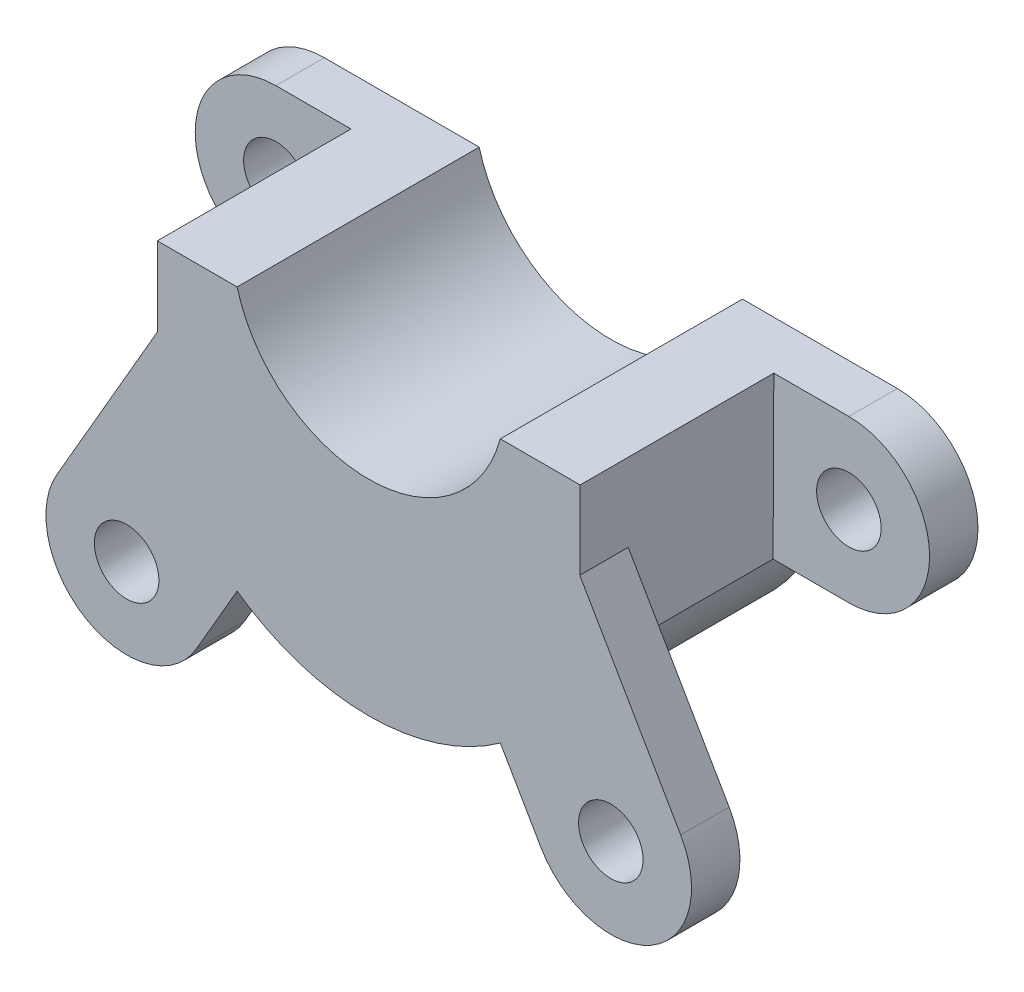
ISO-10303-21;
HEADER;
FILE_DESCRIPTION(('STEP AP214'),'2;1');
FILE_NAME('part.step','',(''),(''),'','','');
FILE_SCHEMA(('AUTOMOTIVE_DESIGN { 1 0 10303 214 1 1 1 1 }'));
ENDSEC;
DATA;
#1=APPLICATION_CONTEXT('core data for automotive mechanical design processes');
#2=APPLICATION_PROTOCOL_DEFINITION('international standard','automotive_design',2000,#1);
#3=PRODUCT_CONTEXT('',#1,'mechanical');
#4=PRODUCT('Part','Part','',(#3));
#5=PRODUCT_RELATED_PRODUCT_CATEGORY('part','',(#4));
#6=PRODUCT_DEFINITION_FORMATION('','',#4);
#7=PRODUCT_DEFINITION_CONTEXT('part definition',#1,'design');
#8=PRODUCT_DEFINITION('design','',#6,#7);
#9=PRODUCT_DEFINITION_SHAPE('','',#8);
#10=(LENGTH_UNIT() NAMED_UNIT(*) SI_UNIT(.MILLI.,.METRE.));
#11=(NAMED_UNIT(*) PLANE_ANGLE_UNIT() SI_UNIT($,.RADIAN.));
#12=(NAMED_UNIT(*) SI_UNIT($,.STERADIAN.) SOLID_ANGLE_UNIT());
#13=UNCERTAINTY_MEASURE_WITH_UNIT(LENGTH_MEASURE(1.E-05),#10,'distance_accuracy_value','');
#14=(GEOMETRIC_REPRESENTATION_CONTEXT(3) GLOBAL_UNCERTAINTY_ASSIGNED_CONTEXT((#13)) GLOBAL_UNIT_ASSIGNED_CONTEXT((#10,
#11,#12)) REPRESENTATION_CONTEXT('',''));
#15=CARTESIAN_POINT('',(0.,0.,0.));
#16=DIRECTION('',(0.,0.,1.));
#17=DIRECTION('',(1.,0.,0.));
#18=AXIS2_PLACEMENT_3D('',#15,#16,#17);
#19=CARTESIAN_POINT('',(0.,0.,3.));
#20=DIRECTION('',(0.,0.,1.));
#21=DIRECTION('',(1.,0.,0.));
#22=AXIS2_PLACEMENT_3D('',#19,#20,#21);
#23=PLANE('',#22);
#24=DIRECTION('',(0.00451459916216712,-0.999989809145276,0.));
#25=VECTOR('',#24,1.);
#26=CARTESIAN_POINT('',(-13.0539708590858,-5.05903595659676,3.));
#27=LINE('',#26,#25);
#28=CARTESIAN_POINT('',(-13.0991173107884,4.94096404340324,3.));
#29=VERTEX_POINT('',#28);
#30=CARTESIAN_POINT('',(-13.0539708590858,-5.05903595659676,3.));
#31=VERTEX_POINT('',#30);
#32=EDGE_CURVE('E56',#29,#31,#27,.T.);
#33=ORIENTED_EDGE('',*,*,#32,.F.);
#34=DIRECTION('',(-1.,0.,0.));
#35=VECTOR('',#34,1.);
#36=CARTESIAN_POINT('',(-13.0991173107884,4.94096404340325,3.));
#37=LINE('',#36,#35);
#38=CARTESIAN_POINT('',(-17.75,4.94096404340325,3.));
#39=VERTEX_POINT('',#38);
#40=EDGE_CURVE('E291',#29,#39,#37,.T.);
#41=ORIENTED_EDGE('',*,*,#40,.T.);
#42=CARTESIAN_POINT('',(-17.75,-0.0590359565967556,3.));
#43=DIRECTION('',(0.,0.,1.));
#44=DIRECTION('',(1.,0.,0.));
#45=AXIS2_PLACEMENT_3D('',#42,#43,#44);
#46=CIRCLE('',#45,5.);
#47=CARTESIAN_POINT('',(-17.75,-5.05903595659675,3.));
#48=VERTEX_POINT('',#47);
#49=EDGE_CURVE('E293',#39,#48,#46,.T.);
#50=ORIENTED_EDGE('',*,*,#49,.T.);
#51=DIRECTION('',(1.,0.,0.));
#52=VECTOR('',#51,1.);
#53=CARTESIAN_POINT('',(-17.75,-5.05903595659675,3.));
#54=LINE('',#53,#52);
#55=EDGE_CURVE('E295',#48,#31,#54,.T.);
#56=ORIENTED_EDGE('',*,*,#55,.T.);
#57=EDGE_LOOP('',(#33,#41,#50,#56));
#58=FACE_BOUND('',#57,.T.);
#59=CARTESIAN_POINT('',(-17.75,-0.0590359565967556,3.));
#60=DIRECTION('',(0.,0.,1.));
#61=DIRECTION('',(1.,0.,0.));
#62=AXIS2_PLACEMENT_3D('',#59,#60,#61);
#63=CIRCLE('',#62,2.);
#64=CARTESIAN_POINT('',(-15.75,-0.0590359565967556,3.));
#65=VERTEX_POINT('',#64);
#66=EDGE_CURVE('E278',#65,#65,#63,.T.);
#67=ORIENTED_EDGE('',*,*,#66,.F.);
#68=EDGE_LOOP('',(#67));
#69=FACE_BOUND('',#68,.T.);
#70=ADVANCED_FACE('F33',(#58,#69),#23,.T.);
#71=DIRECTION('',(0.00451459916216712,0.999989809145276,0.));
#72=VECTOR('',#71,1.);
#73=CARTESIAN_POINT('',(13.0991173107884,4.94096404340325,3.));
#74=LINE('',#73,#72);
#75=CARTESIAN_POINT('',(13.0539708590858,-5.05903595659676,3.));
#76=VERTEX_POINT('',#75);
#77=CARTESIAN_POINT('',(13.0991173107884,4.94096404340325,3.));
#78=VERTEX_POINT('',#77);
#79=EDGE_CURVE('E242',#76,#78,#74,.T.);
#80=ORIENTED_EDGE('',*,*,#79,.F.);
#81=DIRECTION('',(1.,0.,0.));
#82=VECTOR('',#81,1.);
#83=CARTESIAN_POINT('',(13.0539708590858,-5.05903595659676,3.));
#84=LINE('',#83,#82);
#85=CARTESIAN_POINT('',(17.75,-5.05903595659676,3.));
#86=VERTEX_POINT('',#85);
#87=EDGE_CURVE('E284',#76,#86,#84,.T.);
#88=ORIENTED_EDGE('',*,*,#87,.T.);
#89=CARTESIAN_POINT('',(17.75,-0.0590359565967548,3.));
#90=DIRECTION('',(0.,0.,1.));
#91=DIRECTION('',(1.,0.,0.));
#92=AXIS2_PLACEMENT_3D('',#89,#90,#91);
#93=CIRCLE('',#92,5.);
#94=CARTESIAN_POINT('',(17.75,4.94096404340325,3.));
#95=VERTEX_POINT('',#94);
#96=EDGE_CURVE('E286',#86,#95,#93,.T.);
#97=ORIENTED_EDGE('',*,*,#96,.T.);
#98=DIRECTION('',(-1.,0.,0.));
#99=VECTOR('',#98,1.);
#100=CARTESIAN_POINT('',(17.75,4.94096404340325,3.));
#101=LINE('',#100,#99);
#102=EDGE_CURVE('E289',#95,#78,#101,.T.);
#103=ORIENTED_EDGE('',*,*,#102,.T.);
#104=EDGE_LOOP('',(#80,#88,#97,#103));
#105=FACE_BOUND('',#104,.T.);
#106=CARTESIAN_POINT('',(17.75,-0.0590359565967548,3.));
#107=DIRECTION('',(0.,0.,1.));
#108=DIRECTION('',(1.,0.,0.));
#109=AXIS2_PLACEMENT_3D('',#106,#107,#108);
#110=CIRCLE('',#109,2.);
#111=CARTESIAN_POINT('',(19.75,-0.0590359565967548,3.));
#112=VERTEX_POINT('',#111);
#113=EDGE_CURVE('E272',#112,#112,#110,.T.);
#114=ORIENTED_EDGE('',*,*,#113,.F.);
#115=EDGE_LOOP('',(#114));
#116=FACE_BOUND('',#115,.T.);
#117=ADVANCED_FACE('F381',(#105,#116),#23,.T.);
#118=CARTESIAN_POINT('',(0.,0.,0.));
#119=DIRECTION('',(0.,0.,1.));
#120=DIRECTION('',(1.,0.,0.));
#121=AXIS2_PLACEMENT_3D('',#118,#119,#120);
#122=PLANE('',#121);
#123=CARTESIAN_POINT('',(0.,0.,0.));
#124=DIRECTION('',(0.,0.,1.));
#125=DIRECTION('',(1.,0.,0.));
#126=AXIS2_PLACEMENT_3D('',#123,#124,#125);
#127=CIRCLE('',#126,14.);
#128=CARTESIAN_POINT('',(-13.0539708590858,-5.05903595659676,0.));
#129=VERTEX_POINT('',#128);
#130=CARTESIAN_POINT('',(13.0539708590858,-5.05903595659676,0.));
#131=VERTEX_POINT('',#130);
#132=EDGE_CURVE('E281',#129,#131,#127,.T.);
#133=ORIENTED_EDGE('',*,*,#132,.F.);
#134=DIRECTION('',(1.,0.,0.));
#135=VECTOR('',#134,1.);
#136=CARTESIAN_POINT('',(-17.75,-5.05903595659675,0.));
#137=LINE('',#136,#135);
#138=CARTESIAN_POINT('',(-17.75,-5.05903595659675,0.));
#139=VERTEX_POINT('',#138);
#140=EDGE_CURVE('E287',#139,#129,#137,.T.);
#141=ORIENTED_EDGE('',*,*,#140,.F.);
#142=CARTESIAN_POINT('',(-17.75,-0.0590359565967556,0.));
#143=DIRECTION('',(0.,0.,1.));
#144=DIRECTION('',(1.,0.,0.));
#145=AXIS2_PLACEMENT_3D('',#142,#143,#144);
#146=CIRCLE('',#145,5.);
#147=CARTESIAN_POINT('',(-17.75,4.94096404340325,0.));
#148=VERTEX_POINT('',#147);
#149=EDGE_CURVE('E312',#148,#139,#146,.T.);
#150=ORIENTED_EDGE('',*,*,#149,.F.);
#151=DIRECTION('',(-1.,0.,0.));
#152=VECTOR('',#151,1.);
#153=CARTESIAN_POINT('',(-17.75,4.94096404340325,0.));
#154=LINE('',#153,#152);
#155=CARTESIAN_POINT('',(-8.15478239736566,4.94096404340325,0.));
#156=VERTEX_POINT('',#155);
#157=EDGE_CURVE('E310',#156,#148,#154,.T.);
#158=ORIENTED_EDGE('',*,*,#157,.F.);
#159=CARTESIAN_POINT('',(0.,7.14498862529922,0.));
#160=DIRECTION('',(0.,0.,-1.));
#161=DIRECTION('',(1.,0.,0.));
#162=AXIS2_PLACEMENT_3D('',#159,#160,#161);
#163=CIRCLE('',#162,8.44737830962876);
#164=CARTESIAN_POINT('',(8.15478239736565,4.94096404340324,0.));
#165=VERTEX_POINT('',#164);
#166=EDGE_CURVE('E307',#165,#156,#163,.T.);
#167=ORIENTED_EDGE('',*,*,#166,.F.);
#168=DIRECTION('',(-1.,0.,0.));
#169=VECTOR('',#168,1.);
#170=CARTESIAN_POINT('',(8.15478239736566,4.94096404340325,0.));
#171=LINE('',#170,#169);
#172=CARTESIAN_POINT('',(17.75,4.94096404340325,0.));
#173=VERTEX_POINT('',#172);
#174=EDGE_CURVE('E305',#173,#165,#171,.T.);
#175=ORIENTED_EDGE('',*,*,#174,.F.);
#176=CARTESIAN_POINT('',(17.75,-0.0590359565967548,0.));
#177=DIRECTION('',(0.,0.,1.));
#178=DIRECTION('',(1.,0.,0.));
#179=AXIS2_PLACEMENT_3D('',#176,#177,#178);
#180=CIRCLE('',#179,5.);
#181=CARTESIAN_POINT('',(17.75,-5.05903595659676,0.));
#182=VERTEX_POINT('',#181);
#183=EDGE_CURVE('E302',#182,#173,#180,.T.);
#184=ORIENTED_EDGE('',*,*,#183,.F.);
#185=DIRECTION('',(1.,0.,0.));
#186=VECTOR('',#185,1.);
#187=CARTESIAN_POINT('',(13.0539708590858,-5.05903595659676,0.));
#188=LINE('',#187,#186);
#189=EDGE_CURVE('E300',#131,#182,#188,.T.);
#190=ORIENTED_EDGE('',*,*,#189,.F.);
#191=EDGE_LOOP('',(#133,#141,#150,#158,#167,#175,#184,#190));
#192=FACE_BOUND('',#191,.T.);
#193=CARTESIAN_POINT('',(-17.75,-0.0590359565967556,0.));
#194=DIRECTION('',(0.,0.,1.));
#195=DIRECTION('',(1.,0.,0.));
#196=AXIS2_PLACEMENT_3D('',#193,#194,#195);
#197=CIRCLE('',#196,2.);
#198=CARTESIAN_POINT('',(-15.75,-0.0590359565967556,0.));
#199=VERTEX_POINT('',#198);
#200=EDGE_CURVE('E275',#199,#199,#197,.T.);
#201=ORIENTED_EDGE('',*,*,#200,.T.);
#202=EDGE_LOOP('',(#201));
#203=FACE_BOUND('',#202,.T.);
#204=CARTESIAN_POINT('',(17.75,-0.0590359565967548,0.));
#205=DIRECTION('',(0.,0.,1.));
#206=DIRECTION('',(1.,0.,0.));
#207=AXIS2_PLACEMENT_3D('',#204,#205,#206);
#208=CIRCLE('',#207,2.);
#209=CARTESIAN_POINT('',(19.75,-0.0590359565967548,0.));
#210=VERTEX_POINT('',#209);
#211=EDGE_CURVE('E271',#210,#210,#208,.T.);
#212=ORIENTED_EDGE('',*,*,#211,.T.);
#213=EDGE_LOOP('',(#212));
#214=FACE_BOUND('',#213,.T.);
#215=ADVANCED_FACE('F406',(#192,#203,#214),#122,.F.);
#216=CARTESIAN_POINT('',(0.,0.,3.));
#217=DIRECTION('',(0.,0.,-1.));
#218=DIRECTION('',(-1.,0.,0.));
#219=AXIS2_PLACEMENT_3D('',#216,#217,#218);
#220=CYLINDRICAL_SURFACE('',#219,14.);
#221=CARTESIAN_POINT('',(0.,0.,15.));
#222=DIRECTION('',(0.,0.,1.));
#223=DIRECTION('',(1.,0.,0.));
#224=AXIS2_PLACEMENT_3D('',#221,#222,#223);
#225=CIRCLE('',#224,14.);
#226=CARTESIAN_POINT('',(-8.15478239736565,-11.3797857647504,15.));
#227=VERTEX_POINT('',#226);
#228=CARTESIAN_POINT('',(8.15478239736565,-11.3797857647504,15.));
#229=VERTEX_POINT('',#228);
#230=EDGE_CURVE('E243',#227,#229,#225,.T.);
#231=ORIENTED_EDGE('',*,*,#230,.F.);
#232=DIRECTION('',(0.,0.,1.));
#233=VECTOR('',#232,1.);
#234=CARTESIAN_POINT('',(-8.15478239736565,-11.3797857647504,12.));
#235=LINE('',#234,#233);
#236=CARTESIAN_POINT('',(-8.15478239736565,-11.3797857647504,12.));
#237=VERTEX_POINT('',#236);
#238=EDGE_CURVE('E177',#237,#227,#235,.T.);
#239=ORIENTED_EDGE('',*,*,#238,.F.);
#240=CARTESIAN_POINT('',(0.,0.,12.));
#241=DIRECTION('',(0.,0.,-1.));
#242=DIRECTION('',(-1.,0.,0.));
#243=AXIS2_PLACEMENT_3D('',#240,#241,#242);
#244=CIRCLE('',#243,14.);
#245=CARTESIAN_POINT('',(-13.0539708590858,-5.05903595659676,12.));
#246=VERTEX_POINT('',#245);
#247=EDGE_CURVE('E187',#237,#246,#244,.T.);
#248=ORIENTED_EDGE('',*,*,#247,.T.);
#249=DIRECTION('',(0.,0.,-1.));
#250=VECTOR('',#249,1.);
#251=CARTESIAN_POINT('',(-13.0539708590858,-5.05903595659676,15.));
#252=LINE('',#251,#250);
#253=EDGE_CURVE('E258',#246,#31,#252,.T.);
#254=ORIENTED_EDGE('',*,*,#253,.T.);
#255=DIRECTION('',(0.,0.,-1.));
#256=VECTOR('',#255,1.);
#257=CARTESIAN_POINT('',(-13.0539708590858,-5.05903595659676,3.));
#258=LINE('',#257,#256);
#259=EDGE_CURVE('E297',#31,#129,#258,.T.);
#260=ORIENTED_EDGE('',*,*,#259,.T.);
#261=ORIENTED_EDGE('',*,*,#132,.T.);
#262=DIRECTION('',(0.,0.,-1.));
#263=VECTOR('',#262,1.);
#264=CARTESIAN_POINT('',(13.0539708590858,-5.05903595659676,3.));
#265=LINE('',#264,#263);
#266=EDGE_CURVE('E335',#76,#131,#265,.T.);
#267=ORIENTED_EDGE('',*,*,#266,.F.);
#268=DIRECTION('',(0.,0.,-1.));
#269=VECTOR('',#268,1.);
#270=CARTESIAN_POINT('',(13.0539708590858,-5.05903595659676,15.));
#271=LINE('',#270,#269);
#272=CARTESIAN_POINT('',(13.0539708590858,-5.05903595659676,12.));
#273=VERTEX_POINT('',#272);
#274=EDGE_CURVE('E269',#273,#76,#271,.T.);
#275=ORIENTED_EDGE('',*,*,#274,.F.);
#276=CARTESIAN_POINT('',(0.,0.,12.));
#277=DIRECTION('',(0.,0.,1.));
#278=DIRECTION('',(1.,0.,0.));
#279=AXIS2_PLACEMENT_3D('',#276,#277,#278);
#280=CIRCLE('',#279,14.);
#281=CARTESIAN_POINT('',(8.15478239736565,-11.3797857647504,12.));
#282=VERTEX_POINT('',#281);
#283=EDGE_CURVE('E234',#282,#273,#280,.T.);
#284=ORIENTED_EDGE('',*,*,#283,.F.);
#285=DIRECTION('',(0.,0.,1.));
#286=VECTOR('',#285,1.);
#287=CARTESIAN_POINT('',(8.15478239736565,-11.3797857647504,12.));
#288=LINE('',#287,#286);
#289=EDGE_CURVE('E237',#282,#229,#288,.T.);
#290=ORIENTED_EDGE('',*,*,#289,.T.);
#291=EDGE_LOOP('',(#231,#239,#248,#254,#260,#261,#267,#275,#284,#290));
#292=FACE_BOUND('',#291,.T.);
#293=ADVANCED_FACE('F35',(#292),#220,.T.);
#294=CARTESIAN_POINT('',(13.0539708590858,-5.05903595659676,3.));
#295=DIRECTION('',(0.,1.,0.));
#296=DIRECTION('',(-1.,0.,0.));
#297=AXIS2_PLACEMENT_3D('',#294,#295,#296);
#298=PLANE('',#297);
#299=ORIENTED_EDGE('',*,*,#189,.T.);
#300=DIRECTION('',(0.,0.,-1.));
#301=VECTOR('',#300,1.);
#302=CARTESIAN_POINT('',(17.75,-5.05903595659676,3.));
#303=LINE('',#302,#301);
#304=EDGE_CURVE('E332',#86,#182,#303,.T.);
#305=ORIENTED_EDGE('',*,*,#304,.F.);
#306=ORIENTED_EDGE('',*,*,#87,.F.);
#307=ORIENTED_EDGE('',*,*,#266,.T.);
#308=EDGE_LOOP('',(#299,#305,#306,#307));
#309=FACE_BOUND('',#308,.T.);
#310=ADVANCED_FACE('F386',(#309),#298,.F.);
#311=CARTESIAN_POINT('',(17.75,-0.0590359565967548,3.));
#312=DIRECTION('',(0.,0.,-1.));
#313=DIRECTION('',(-1.,0.,0.));
#314=AXIS2_PLACEMENT_3D('',#311,#312,#313);
#315=CYLINDRICAL_SURFACE('',#314,5.);
#316=ORIENTED_EDGE('',*,*,#183,.T.);
#317=DIRECTION('',(0.,0.,-1.));
#318=VECTOR('',#317,1.);
#319=CARTESIAN_POINT('',(17.75,4.94096404340325,3.));
#320=LINE('',#319,#318);
#321=EDGE_CURVE('E329',#95,#173,#320,.T.);
#322=ORIENTED_EDGE('',*,*,#321,.F.);
#323=ORIENTED_EDGE('',*,*,#96,.F.);
#324=ORIENTED_EDGE('',*,*,#304,.T.);
#325=EDGE_LOOP('',(#316,#322,#323,#324));
#326=FACE_BOUND('',#325,.T.);
#327=ADVANCED_FACE('F391',(#326),#315,.T.);
#328=CARTESIAN_POINT('',(8.15478239736566,4.94096404340325,3.));
#329=DIRECTION('',(0.,-1.,0.));
#330=DIRECTION('',(0.,0.,-1.));
#331=AXIS2_PLACEMENT_3D('',#328,#329,#330);
#332=PLANE('',#331);
#333=ORIENTED_EDGE('',*,*,#174,.T.);
#334=DIRECTION('',(0.,0.,-1.));
#335=VECTOR('',#334,1.);
#336=CARTESIAN_POINT('',(8.15478239736565,4.94096404340324,3.));
#337=LINE('',#336,#335);
#338=CARTESIAN_POINT('',(8.15478239736565,4.94096404340324,15.));
#339=VERTEX_POINT('',#338);
#340=EDGE_CURVE('E326',#339,#165,#337,.T.);
#341=ORIENTED_EDGE('',*,*,#340,.F.);
#342=DIRECTION('',(-1.,0.,0.));
#343=VECTOR('',#342,1.);
#344=CARTESIAN_POINT('',(8.15478239736565,4.94096404340324,15.));
#345=LINE('',#344,#343);
#346=CARTESIAN_POINT('',(13.0991173107884,4.94096404340325,15.));
#347=VERTEX_POINT('',#346);
#348=EDGE_CURVE('E247',#347,#339,#345,.T.);
#349=ORIENTED_EDGE('',*,*,#348,.F.);
#350=DIRECTION('',(0.,0.,-1.));
#351=VECTOR('',#350,1.);
#352=CARTESIAN_POINT('',(13.0991173107884,4.94096404340325,15.));
#353=LINE('',#352,#351);
#354=EDGE_CURVE('E266',#347,#78,#353,.T.);
#355=ORIENTED_EDGE('',*,*,#354,.T.);
#356=ORIENTED_EDGE('',*,*,#102,.F.);
#357=ORIENTED_EDGE('',*,*,#321,.T.);
#358=EDGE_LOOP('',(#333,#341,#349,#355,#356,#357));
#359=FACE_BOUND('',#358,.T.);
#360=ADVANCED_FACE('F392',(#359),#332,.F.);
#361=CARTESIAN_POINT('',(0.,7.14498862529922,3.));
#362=DIRECTION('',(0.,0.,-1.));
#363=DIRECTION('',(-1.,0.,0.));
#364=AXIS2_PLACEMENT_3D('',#361,#362,#363);
#365=CYLINDRICAL_SURFACE('',#364,8.44737830962876);
#366=ORIENTED_EDGE('',*,*,#166,.T.);
#367=DIRECTION('',(0.,0.,-1.));
#368=VECTOR('',#367,1.);
#369=CARTESIAN_POINT('',(-8.15478239736566,4.94096404340325,3.));
#370=LINE('',#369,#368);
#371=CARTESIAN_POINT('',(-8.15478239736566,4.94096404340325,15.));
#372=VERTEX_POINT('',#371);
#373=EDGE_CURVE('E323',#372,#156,#370,.T.);
#374=ORIENTED_EDGE('',*,*,#373,.F.);
#375=CARTESIAN_POINT('',(0.,7.14498862529922,15.));
#376=DIRECTION('',(0.,0.,-1.));
#377=DIRECTION('',(1.,0.,0.));
#378=AXIS2_PLACEMENT_3D('',#375,#376,#377);
#379=CIRCLE('',#378,8.44737830962876);
#380=EDGE_CURVE('E250',#339,#372,#379,.T.);
#381=ORIENTED_EDGE('',*,*,#380,.F.);
#382=ORIENTED_EDGE('',*,*,#340,.T.);
#383=EDGE_LOOP('',(#366,#374,#381,#382));
#384=FACE_BOUND('',#383,.T.);
#385=ADVANCED_FACE('F359',(#384),#365,.F.);
#386=CARTESIAN_POINT('',(-17.75,4.94096404340325,3.));
#387=DIRECTION('',(0.,-1.,0.));
#388=DIRECTION('',(1.,0.,0.));
#389=AXIS2_PLACEMENT_3D('',#386,#387,#388);
#390=PLANE('',#389);
#391=ORIENTED_EDGE('',*,*,#157,.T.);
#392=DIRECTION('',(0.,0.,-1.));
#393=VECTOR('',#392,1.);
#394=CARTESIAN_POINT('',(-17.75,4.94096404340325,3.));
#395=LINE('',#394,#393);
#396=EDGE_CURVE('E320',#39,#148,#395,.T.);
#397=ORIENTED_EDGE('',*,*,#396,.F.);
#398=ORIENTED_EDGE('',*,*,#40,.F.);
#399=DIRECTION('',(0.,0.,-1.));
#400=VECTOR('',#399,1.);
#401=CARTESIAN_POINT('',(-13.0991173107884,4.94096404340325,15.));
#402=LINE('',#401,#400);
#403=CARTESIAN_POINT('',(-13.0991173107884,4.94096404340325,15.));
#404=VERTEX_POINT('',#403);
#405=EDGE_CURVE('E263',#404,#29,#402,.T.);
#406=ORIENTED_EDGE('',*,*,#405,.F.);
#407=DIRECTION('',(-1.,0.,0.));
#408=VECTOR('',#407,1.);
#409=CARTESIAN_POINT('',(-13.0991173107884,4.94096404340325,15.));
#410=LINE('',#409,#408);
#411=EDGE_CURVE('E253',#372,#404,#410,.T.);
#412=ORIENTED_EDGE('',*,*,#411,.F.);
#413=ORIENTED_EDGE('',*,*,#373,.T.);
#414=EDGE_LOOP('',(#391,#397,#398,#406,#412,#413));
#415=FACE_BOUND('',#414,.T.);
#416=ADVANCED_FACE('F362',(#415),#390,.F.);
#417=CARTESIAN_POINT('',(-17.75,-0.0590359565967556,3.));
#418=DIRECTION('',(0.,0.,-1.));
#419=DIRECTION('',(-1.,0.,0.));
#420=AXIS2_PLACEMENT_3D('',#417,#418,#419);
#421=CYLINDRICAL_SURFACE('',#420,5.);
#422=ORIENTED_EDGE('',*,*,#149,.T.);
#423=DIRECTION('',(0.,0.,-1.));
#424=VECTOR('',#423,1.);
#425=CARTESIAN_POINT('',(-17.75,-5.05903595659675,3.));
#426=LINE('',#425,#424);
#427=EDGE_CURVE('E317',#48,#139,#426,.T.);
#428=ORIENTED_EDGE('',*,*,#427,.F.);
#429=ORIENTED_EDGE('',*,*,#49,.F.);
#430=ORIENTED_EDGE('',*,*,#396,.T.);
#431=EDGE_LOOP('',(#422,#428,#429,#430));
#432=FACE_BOUND('',#431,.T.);
#433=ADVANCED_FACE('F418',(#432),#421,.T.);
#434=CARTESIAN_POINT('',(-17.75,-5.05903595659675,3.));
#435=DIRECTION('',(0.,1.,0.));
#436=DIRECTION('',(-1.,0.,0.));
#437=AXIS2_PLACEMENT_3D('',#434,#435,#436);
#438=PLANE('',#437);
#439=ORIENTED_EDGE('',*,*,#140,.T.);
#440=ORIENTED_EDGE('',*,*,#259,.F.);
#441=ORIENTED_EDGE('',*,*,#55,.F.);
#442=ORIENTED_EDGE('',*,*,#427,.T.);
#443=EDGE_LOOP('',(#439,#440,#441,#442));
#444=FACE_BOUND('',#443,.T.);
#445=ADVANCED_FACE('F415',(#444),#438,.F.);
#446=CARTESIAN_POINT('',(-17.75,-0.0590359565967556,3.));
#447=DIRECTION('',(0.,0.,-1.));
#448=DIRECTION('',(-1.,0.,0.));
#449=AXIS2_PLACEMENT_3D('',#446,#447,#448);
#450=CYLINDRICAL_SURFACE('',#449,2.);
#451=ORIENTED_EDGE('',*,*,#66,.T.);
#452=EDGE_LOOP('',(#451));
#453=FACE_BOUND('',#452,.T.);
#454=ORIENTED_EDGE('',*,*,#200,.F.);
#455=EDGE_LOOP('',(#454));
#456=FACE_BOUND('',#455,.T.);
#457=ADVANCED_FACE('F410',(#453,#456),#450,.F.);
#458=CARTESIAN_POINT('',(17.75,-0.0590359565967548,3.));
#459=DIRECTION('',(0.,0.,-1.));
#460=DIRECTION('',(-1.,0.,0.));
#461=AXIS2_PLACEMENT_3D('',#458,#459,#460);
#462=CYLINDRICAL_SURFACE('',#461,2.);
#463=ORIENTED_EDGE('',*,*,#113,.T.);
#464=EDGE_LOOP('',(#463));
#465=FACE_BOUND('',#464,.T.);
#466=ORIENTED_EDGE('',*,*,#211,.F.);
#467=EDGE_LOOP('',(#466));
#468=FACE_BOUND('',#467,.T.);
#469=ADVANCED_FACE('F444',(#465,#468),#462,.F.);
#470=CARTESIAN_POINT('',(13.0991173107884,4.94096404340325,15.));
#471=DIRECTION('',(-0.999989809145276,0.00451459916216712,0.));
#472=DIRECTION('',(-0.00451459916216712,-0.999989809145276,0.));
#473=AXIS2_PLACEMENT_3D('',#470,#471,#472);
#474=PLANE('',#473);
#475=DIRECTION('',(0.00451459916216712,0.999989809145276,0.));
#476=VECTOR('',#475,1.);
#477=CARTESIAN_POINT('',(13.0991173107884,4.94096404340325,15.));
#478=LINE('',#477,#476);
#479=CARTESIAN_POINT('',(13.0771877077478,0.0835273648723302,15.));
#480=VERTEX_POINT('',#479);
#481=EDGE_CURVE('E245',#480,#347,#478,.T.);
#482=ORIENTED_EDGE('',*,*,#481,.F.);
#483=DIRECTION('',(0.,0.,1.));
#484=VECTOR('',#483,1.);
#485=CARTESIAN_POINT('',(13.0771877077478,0.0835273648723284,12.));
#486=LINE('',#485,#484);
#487=CARTESIAN_POINT('',(13.0771877077478,0.0835273648723284,12.));
#488=VERTEX_POINT('',#487);
#489=EDGE_CURVE('E226',#488,#480,#486,.T.);
#490=ORIENTED_EDGE('',*,*,#489,.F.);
#491=DIRECTION('',(0.00451459916216712,0.999989809145276,0.));
#492=VECTOR('',#491,1.);
#493=CARTESIAN_POINT('',(13.0991173107884,4.94096404340325,12.));
#494=LINE('',#493,#492);
#495=EDGE_CURVE('E41',#273,#488,#494,.T.);
#496=ORIENTED_EDGE('',*,*,#495,.F.);
#497=ORIENTED_EDGE('',*,*,#274,.T.);
#498=ORIENTED_EDGE('',*,*,#79,.T.);
#499=ORIENTED_EDGE('',*,*,#354,.F.);
#500=EDGE_LOOP('',(#482,#490,#496,#497,#498,#499));
#501=FACE_BOUND('',#500,.T.);
#502=ADVANCED_FACE('F350',(#501),#474,.F.);
#503=CARTESIAN_POINT('',(-13.0539708590858,-5.05903595659676,15.));
#504=DIRECTION('',(0.999989809145276,0.00451459916216712,0.));
#505=DIRECTION('',(-0.00451459916216712,0.999989809145276,0.));
#506=AXIS2_PLACEMENT_3D('',#503,#504,#505);
#507=PLANE('',#506);
#508=DIRECTION('',(-0.00451459916216712,0.999989809145276,0.));
#509=VECTOR('',#508,1.);
#510=CARTESIAN_POINT('',(-13.0539708590858,-5.05903595659676,12.));
#511=LINE('',#510,#509);
#512=CARTESIAN_POINT('',(-13.0771877077478,0.0835273648723432,12.));
#513=VERTEX_POINT('',#512);
#514=EDGE_CURVE('E11',#246,#513,#511,.T.);
#515=ORIENTED_EDGE('',*,*,#514,.T.);
#516=DIRECTION('',(0.,0.,1.));
#517=VECTOR('',#516,1.);
#518=CARTESIAN_POINT('',(-13.0771877077478,0.0835273648723432,12.));
#519=LINE('',#518,#517);
#520=CARTESIAN_POINT('',(-13.0771877077478,0.0835273648723432,15.));
#521=VERTEX_POINT('',#520);
#522=EDGE_CURVE('E205',#513,#521,#519,.T.);
#523=ORIENTED_EDGE('',*,*,#522,.T.);
#524=DIRECTION('',(0.00451459916216712,-0.999989809145276,0.));
#525=VECTOR('',#524,1.);
#526=CARTESIAN_POINT('',(-13.0539708590858,-5.05903595659676,15.));
#527=LINE('',#526,#525);
#528=EDGE_CURVE('E255',#404,#521,#527,.T.);
#529=ORIENTED_EDGE('',*,*,#528,.F.);
#530=ORIENTED_EDGE('',*,*,#405,.T.);
#531=ORIENTED_EDGE('',*,*,#32,.T.);
#532=ORIENTED_EDGE('',*,*,#253,.F.);
#533=EDGE_LOOP('',(#515,#523,#529,#530,#531,#532));
#534=FACE_BOUND('',#533,.T.);
#535=ADVANCED_FACE('F367',(#534),#507,.F.);
#536=CARTESIAN_POINT('',(0.,0.,15.));
#537=DIRECTION('',(0.,0.,1.));
#538=DIRECTION('',(1.,0.,0.));
#539=AXIS2_PLACEMENT_3D('',#536,#537,#538);
#540=PLANE('',#539);
#541=DIRECTION('',(0.500628309746129,0.865662344959473,0.));
#542=VECTOR('',#541,1.);
#543=CARTESIAN_POINT('',(-10.6716882752026,-15.7318981040536,15.));
#544=LINE('',#543,#542);
#545=CARTESIAN_POINT('',(-10.6716882752026,-15.7318981040536,15.));
#546=VERTEX_POINT('',#545);
#547=EDGE_CURVE('E172',#546,#227,#544,.T.);
#548=ORIENTED_EDGE('',*,*,#547,.T.);
#549=ORIENTED_EDGE('',*,*,#230,.T.);
#550=DIRECTION('',(0.500628309746129,-0.865662344959473,0.));
#551=VECTOR('',#550,1.);
#552=CARTESIAN_POINT('',(10.6716882752026,-15.7318981040536,15.));
#553=LINE('',#552,#551);
#554=CARTESIAN_POINT('',(10.6716882752026,-15.7318981040536,15.));
#555=VERTEX_POINT('',#554);
#556=EDGE_CURVE('E228',#229,#555,#553,.T.);
#557=ORIENTED_EDGE('',*,*,#556,.T.);
#558=CARTESIAN_POINT('',(15.,-13.228756555323,15.));
#559=DIRECTION('',(0.,0.,1.));
#560=DIRECTION('',(1.,0.,0.));
#561=AXIS2_PLACEMENT_3D('',#558,#559,#560);
#562=CIRCLE('',#561,5.);
#563=CARTESIAN_POINT('',(19.3283117247974,-10.7256150065923,15.));
#564=VERTEX_POINT('',#563);
#565=EDGE_CURVE('E220',#555,#564,#562,.T.);
#566=ORIENTED_EDGE('',*,*,#565,.T.);
#567=DIRECTION('',(-0.500628309746128,0.865662344959474,0.));
#568=VECTOR('',#567,1.);
#569=CARTESIAN_POINT('',(19.3283117247974,-10.7256150065923,15.));
#570=LINE('',#569,#568);
#571=EDGE_CURVE('E48',#564,#480,#570,.T.);
#572=ORIENTED_EDGE('',*,*,#571,.T.);
#573=ORIENTED_EDGE('',*,*,#481,.T.);
#574=ORIENTED_EDGE('',*,*,#348,.T.);
#575=ORIENTED_EDGE('',*,*,#380,.T.);
#576=ORIENTED_EDGE('',*,*,#411,.T.);
#577=ORIENTED_EDGE('',*,*,#528,.T.);
#578=DIRECTION('',(-0.500628309746128,-0.865662344959474,0.));
#579=VECTOR('',#578,1.);
#580=CARTESIAN_POINT('',(-19.3283117247974,-10.7256150065923,15.));
#581=LINE('',#580,#579);
#582=CARTESIAN_POINT('',(-19.3283117247974,-10.7256150065923,15.));
#583=VERTEX_POINT('',#582);
#584=EDGE_CURVE('E191',#521,#583,#581,.T.);
#585=ORIENTED_EDGE('',*,*,#584,.T.);
#586=CARTESIAN_POINT('',(-15.,-13.228756555323,15.));
#587=DIRECTION('',(0.,0.,1.));
#588=DIRECTION('',(-1.,0.,0.));
#589=AXIS2_PLACEMENT_3D('',#586,#587,#588);
#590=CIRCLE('',#589,5.);
#591=EDGE_CURVE('E200',#583,#546,#590,.T.);
#592=ORIENTED_EDGE('',*,*,#591,.T.);
#593=EDGE_LOOP('',(#548,#549,#557,#566,#572,#573,#574,#575,#576,#577,#585,#592));
#594=FACE_BOUND('',#593,.T.);
#595=CARTESIAN_POINT('',(15.,-13.228756555323,15.));
#596=DIRECTION('',(0.,0.,1.));
#597=DIRECTION('',(-1.,0.,0.));
#598=AXIS2_PLACEMENT_3D('',#595,#596,#597);
#599=CIRCLE('',#598,2.);
#600=CARTESIAN_POINT('',(13.,-13.228756555323,15.));
#601=VERTEX_POINT('',#600);
#602=EDGE_CURVE('E210',#601,#601,#599,.T.);
#603=ORIENTED_EDGE('',*,*,#602,.F.);
#604=EDGE_LOOP('',(#603));
#605=FACE_BOUND('',#604,.T.);
#606=CARTESIAN_POINT('',(-15.,-13.228756555323,15.));
#607=DIRECTION('',(0.,0.,1.));
#608=DIRECTION('',(1.,0.,0.));
#609=AXIS2_PLACEMENT_3D('',#606,#607,#608);
#610=CIRCLE('',#609,2.);
#611=CARTESIAN_POINT('',(-13.,-13.228756555323,15.));
#612=VERTEX_POINT('',#611);
#613=EDGE_CURVE('E196',#612,#612,#610,.T.);
#614=ORIENTED_EDGE('',*,*,#613,.F.);
#615=EDGE_LOOP('',(#614));
#616=FACE_BOUND('',#615,.T.);
#617=ADVANCED_FACE('F353',(#594,#605,#616),#540,.T.);
#618=CARTESIAN_POINT('',(15.,-13.228756555323,12.));
#619=DIRECTION('',(0.,0.,1.));
#620=DIRECTION('',(1.,0.,0.));
#621=AXIS2_PLACEMENT_3D('',#618,#619,#620);
#622=PLANE('',#621);
#623=CARTESIAN_POINT('',(15.,-13.228756555323,12.));
#624=DIRECTION('',(0.,0.,1.));
#625=DIRECTION('',(-1.,0.,0.));
#626=AXIS2_PLACEMENT_3D('',#623,#624,#625);
#627=CIRCLE('',#626,2.);
#628=CARTESIAN_POINT('',(13.,-13.228756555323,12.));
#629=VERTEX_POINT('',#628);
#630=EDGE_CURVE('E211',#629,#629,#627,.T.);
#631=ORIENTED_EDGE('',*,*,#630,.T.);
#632=EDGE_LOOP('',(#631));
#633=FACE_BOUND('',#632,.T.);
#634=DIRECTION('',(0.500628309746129,-0.865662344959473,0.));
#635=VECTOR('',#634,1.);
#636=CARTESIAN_POINT('',(10.6716882752026,-15.7318981040536,12.));
#637=LINE('',#636,#635);
#638=CARTESIAN_POINT('',(10.6716882752026,-15.7318981040536,12.));
#639=VERTEX_POINT('',#638);
#640=EDGE_CURVE('E219',#282,#639,#637,.T.);
#641=ORIENTED_EDGE('',*,*,#640,.F.);
#642=ORIENTED_EDGE('',*,*,#283,.T.);
#643=ORIENTED_EDGE('',*,*,#495,.T.);
#644=DIRECTION('',(-0.500628309746128,0.865662344959474,0.));
#645=VECTOR('',#644,1.);
#646=CARTESIAN_POINT('',(19.3283117247974,-10.7256150065923,12.));
#647=LINE('',#646,#645);
#648=CARTESIAN_POINT('',(19.3283117247974,-10.7256150065923,12.));
#649=VERTEX_POINT('',#648);
#650=EDGE_CURVE('E216',#649,#488,#647,.T.);
#651=ORIENTED_EDGE('',*,*,#650,.F.);
#652=CARTESIAN_POINT('',(15.,-13.228756555323,12.));
#653=DIRECTION('',(0.,0.,1.));
#654=DIRECTION('',(1.,0.,0.));
#655=AXIS2_PLACEMENT_3D('',#652,#653,#654);
#656=CIRCLE('',#655,5.);
#657=EDGE_CURVE('E223',#639,#649,#656,.T.);
#658=ORIENTED_EDGE('',*,*,#657,.F.);
#659=EDGE_LOOP('',(#641,#642,#643,#651,#658));
#660=FACE_BOUND('',#659,.T.);
#661=ADVANCED_FACE('F341',(#633,#660),#622,.F.);
#662=CARTESIAN_POINT('',(19.3283117247974,-10.7256150065923,12.));
#663=DIRECTION('',(0.865662344959474,0.500628309746128,0.));
#664=DIRECTION('',(-0.500628309746128,0.865662344959474,0.));
#665=AXIS2_PLACEMENT_3D('',#662,#663,#664);
#666=PLANE('',#665);
#667=ORIENTED_EDGE('',*,*,#571,.F.);
#668=DIRECTION('',(0.,0.,1.));
#669=VECTOR('',#668,1.);
#670=CARTESIAN_POINT('',(19.3283117247974,-10.7256150065923,12.));
#671=LINE('',#670,#669);
#672=EDGE_CURVE('E232',#649,#564,#671,.T.);
#673=ORIENTED_EDGE('',*,*,#672,.F.);
#674=ORIENTED_EDGE('',*,*,#650,.T.);
#675=ORIENTED_EDGE('',*,*,#489,.T.);
#676=EDGE_LOOP('',(#667,#673,#674,#675));
#677=FACE_BOUND('',#676,.T.);
#678=ADVANCED_FACE('F348',(#677),#666,.T.);
#679=CARTESIAN_POINT('',(15.,-13.228756555323,12.));
#680=DIRECTION('',(0.,0.,1.));
#681=DIRECTION('',(1.,0.,0.));
#682=AXIS2_PLACEMENT_3D('',#679,#680,#681);
#683=CYLINDRICAL_SURFACE('',#682,5.);
#684=ORIENTED_EDGE('',*,*,#565,.F.);
#685=DIRECTION('',(0.,0.,1.));
#686=VECTOR('',#685,1.);
#687=CARTESIAN_POINT('',(10.6716882752026,-15.7318981040536,12.));
#688=LINE('',#687,#686);
#689=EDGE_CURVE('E235',#639,#555,#688,.T.);
#690=ORIENTED_EDGE('',*,*,#689,.F.);
#691=ORIENTED_EDGE('',*,*,#657,.T.);
#692=ORIENTED_EDGE('',*,*,#672,.T.);
#693=EDGE_LOOP('',(#684,#690,#691,#692));
#694=FACE_BOUND('',#693,.T.);
#695=ADVANCED_FACE('F482',(#694),#683,.T.);
#696=CARTESIAN_POINT('',(10.6716882752026,-15.7318981040536,12.));
#697=DIRECTION('',(-0.865662344959473,-0.500628309746129,0.));
#698=DIRECTION('',(0.500628309746129,-0.865662344959473,0.));
#699=AXIS2_PLACEMENT_3D('',#696,#697,#698);
#700=PLANE('',#699);
#701=ORIENTED_EDGE('',*,*,#556,.F.);
#702=ORIENTED_EDGE('',*,*,#289,.F.);
#703=ORIENTED_EDGE('',*,*,#640,.T.);
#704=ORIENTED_EDGE('',*,*,#689,.T.);
#705=EDGE_LOOP('',(#701,#702,#703,#704));
#706=FACE_BOUND('',#705,.T.);
#707=ADVANCED_FACE('F376',(#706),#700,.T.);
#708=CARTESIAN_POINT('',(15.,-13.228756555323,12.));
#709=DIRECTION('',(0.,0.,1.));
#710=DIRECTION('',(1.,0.,0.));
#711=AXIS2_PLACEMENT_3D('',#708,#709,#710);
#712=CYLINDRICAL_SURFACE('',#711,2.);
#713=ORIENTED_EDGE('',*,*,#630,.F.);
#714=EDGE_LOOP('',(#713));
#715=FACE_BOUND('',#714,.T.);
#716=ORIENTED_EDGE('',*,*,#602,.T.);
#717=EDGE_LOOP('',(#716));
#718=FACE_BOUND('',#717,.T.);
#719=ADVANCED_FACE('F496',(#715,#718),#712,.F.);
#720=CARTESIAN_POINT('',(-15.,-13.228756555323,12.));
#721=DIRECTION('',(0.,0.,-1.));
#722=DIRECTION('',(-1.,0.,0.));
#723=AXIS2_PLACEMENT_3D('',#720,#721,#722);
#724=PLANE('',#723);
#725=CARTESIAN_POINT('',(-15.,-13.228756555323,12.));
#726=DIRECTION('',(0.,0.,1.));
#727=DIRECTION('',(1.,0.,0.));
#728=AXIS2_PLACEMENT_3D('',#725,#726,#727);
#729=CIRCLE('',#728,2.);
#730=CARTESIAN_POINT('',(-13.,-13.228756555323,12.));
#731=VERTEX_POINT('',#730);
#732=EDGE_CURVE('E202',#731,#731,#729,.T.);
#733=ORIENTED_EDGE('',*,*,#732,.T.);
#734=EDGE_LOOP('',(#733));
#735=FACE_BOUND('',#734,.T.);
#736=ORIENTED_EDGE('',*,*,#247,.F.);
#737=DIRECTION('',(0.500628309746129,0.865662344959473,0.));
#738=VECTOR('',#737,1.);
#739=CARTESIAN_POINT('',(-10.6716882752026,-15.7318981040536,12.));
#740=LINE('',#739,#738);
#741=CARTESIAN_POINT('',(-10.6716882752026,-15.7318981040536,12.));
#742=VERTEX_POINT('',#741);
#743=EDGE_CURVE('E169',#742,#237,#740,.T.);
#744=ORIENTED_EDGE('',*,*,#743,.F.);
#745=CARTESIAN_POINT('',(-15.,-13.228756555323,12.));
#746=DIRECTION('',(0.,0.,1.));
#747=DIRECTION('',(-1.,0.,0.));
#748=AXIS2_PLACEMENT_3D('',#745,#746,#747);
#749=CIRCLE('',#748,5.);
#750=CARTESIAN_POINT('',(-19.3283117247974,-10.7256150065923,12.));
#751=VERTEX_POINT('',#750);
#752=EDGE_CURVE('E184',#751,#742,#749,.T.);
#753=ORIENTED_EDGE('',*,*,#752,.F.);
#754=DIRECTION('',(-0.500628309746128,-0.865662344959474,0.));
#755=VECTOR('',#754,1.);
#756=CARTESIAN_POINT('',(-19.3283117247974,-10.7256150065923,12.));
#757=LINE('',#756,#755);
#758=EDGE_CURVE('E178',#513,#751,#757,.T.);
#759=ORIENTED_EDGE('',*,*,#758,.F.);
#760=ORIENTED_EDGE('',*,*,#514,.F.);
#761=EDGE_LOOP('',(#736,#744,#753,#759,#760));
#762=FACE_BOUND('',#761,.T.);
#763=ADVANCED_FACE('F182',(#735,#762),#724,.T.);
#764=CARTESIAN_POINT('',(-15.,-13.228756555323,12.));
#765=DIRECTION('',(0.,0.,1.));
#766=DIRECTION('',(1.,0.,0.));
#767=AXIS2_PLACEMENT_3D('',#764,#765,#766);
#768=CYLINDRICAL_SURFACE('',#767,5.);
#769=ORIENTED_EDGE('',*,*,#591,.F.);
#770=DIRECTION('',(0.,0.,1.));
#771=VECTOR('',#770,1.);
#772=CARTESIAN_POINT('',(-19.3283117247974,-10.7256150065923,12.));
#773=LINE('',#772,#771);
#774=EDGE_CURVE('E190',#751,#583,#773,.T.);
#775=ORIENTED_EDGE('',*,*,#774,.F.);
#776=ORIENTED_EDGE('',*,*,#752,.T.);
#777=DIRECTION('',(0.,0.,1.));
#778=VECTOR('',#777,1.);
#779=CARTESIAN_POINT('',(-10.6716882752026,-15.7318981040536,12.));
#780=LINE('',#779,#778);
#781=EDGE_CURVE('E166',#742,#546,#780,.T.);
#782=ORIENTED_EDGE('',*,*,#781,.T.);
#783=EDGE_LOOP('',(#769,#775,#776,#782));
#784=FACE_BOUND('',#783,.T.);
#785=ADVANCED_FACE('F189',(#784),#768,.T.);
#786=CARTESIAN_POINT('',(-19.3283117247974,-10.7256150065923,12.));
#787=DIRECTION('',(-0.865662344959474,0.500628309746128,0.));
#788=DIRECTION('',(-0.500628309746128,-0.865662344959474,0.));
#789=AXIS2_PLACEMENT_3D('',#786,#787,#788);
#790=PLANE('',#789);
#791=ORIENTED_EDGE('',*,*,#584,.F.);
#792=ORIENTED_EDGE('',*,*,#522,.F.);
#793=ORIENTED_EDGE('',*,*,#758,.T.);
#794=ORIENTED_EDGE('',*,*,#774,.T.);
#795=EDGE_LOOP('',(#791,#792,#793,#794));
#796=FACE_BOUND('',#795,.T.);
#797=ADVANCED_FACE('F370',(#796),#790,.T.);
#798=CARTESIAN_POINT('',(-10.6716882752026,-15.7318981040536,12.));
#799=DIRECTION('',(0.865662344959473,-0.500628309746129,0.));
#800=DIRECTION('',(0.500628309746129,0.865662344959473,0.));
#801=AXIS2_PLACEMENT_3D('',#798,#799,#800);
#802=PLANE('',#801);
#803=ORIENTED_EDGE('',*,*,#547,.F.);
#804=ORIENTED_EDGE('',*,*,#781,.F.);
#805=ORIENTED_EDGE('',*,*,#743,.T.);
#806=ORIENTED_EDGE('',*,*,#238,.T.);
#807=EDGE_LOOP('',(#803,#804,#805,#806));
#808=FACE_BOUND('',#807,.T.);
#809=ADVANCED_FACE('F168',(#808),#802,.T.);
#810=CARTESIAN_POINT('',(-15.,-13.228756555323,12.));
#811=DIRECTION('',(0.,0.,1.));
#812=DIRECTION('',(1.,0.,0.));
#813=AXIS2_PLACEMENT_3D('',#810,#811,#812);
#814=CYLINDRICAL_SURFACE('',#813,2.);
#815=ORIENTED_EDGE('',*,*,#732,.F.);
#816=EDGE_LOOP('',(#815));
#817=FACE_BOUND('',#816,.T.);
#818=ORIENTED_EDGE('',*,*,#613,.T.);
#819=EDGE_LOOP('',(#818));
#820=FACE_BOUND('',#819,.T.);
#821=ADVANCED_FACE('F529',(#817,#820),#814,.F.);
#822=CLOSED_SHELL('',(#70,#117,#215,#293,#310,#327,#360,#385,#416,#433,#445,#457,#469,#502,#535,
#617,#661,#678,#695,#707,#719,#763,#785,#797,#809,#821));
#823=MANIFOLD_SOLID_BREP('B2',#822);
#824=ADVANCED_BREP_SHAPE_REPRESENTATION('',(#18,#823),#14);
#825=SHAPE_DEFINITION_REPRESENTATION(#9,#824);
ENDSEC;
END-ISO-10303-21;
